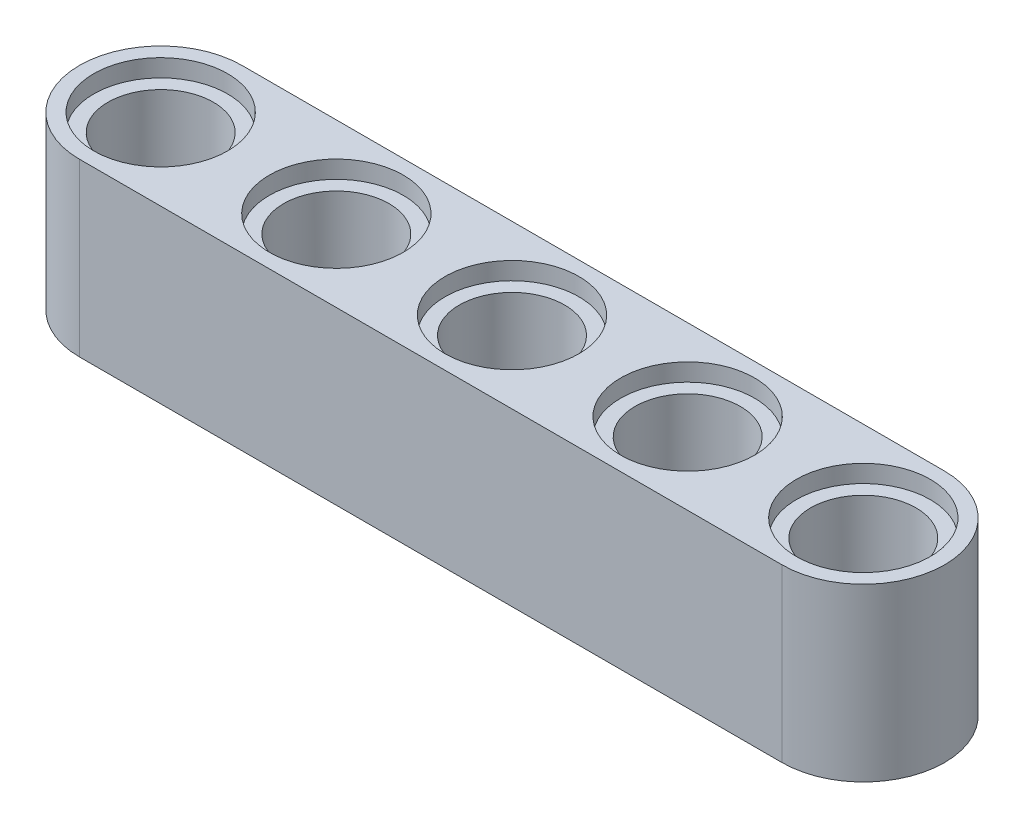
ISO-10303-21;
HEADER;
FILE_DESCRIPTION(('STEP AP214'),'2;1');
FILE_NAME('part.step','',(''),(''),'','','');
FILE_SCHEMA(('AUTOMOTIVE_DESIGN { 1 0 10303 214 1 1 1 1 }'));
ENDSEC;
DATA;
#1=APPLICATION_CONTEXT('core data for automotive mechanical design processes');
#2=APPLICATION_PROTOCOL_DEFINITION('international standard','automotive_design',2000,#1);
#3=PRODUCT_CONTEXT('',#1,'mechanical');
#4=PRODUCT('Part','Part','',(#3));
#5=PRODUCT_RELATED_PRODUCT_CATEGORY('part','',(#4));
#6=PRODUCT_DEFINITION_FORMATION('','',#4);
#7=PRODUCT_DEFINITION_CONTEXT('part definition',#1,'design');
#8=PRODUCT_DEFINITION('design','',#6,#7);
#9=PRODUCT_DEFINITION_SHAPE('','',#8);
#10=(LENGTH_UNIT() NAMED_UNIT(*) SI_UNIT(.MILLI.,.METRE.));
#11=(NAMED_UNIT(*) PLANE_ANGLE_UNIT() SI_UNIT($,.RADIAN.));
#12=(NAMED_UNIT(*) SI_UNIT($,.STERADIAN.) SOLID_ANGLE_UNIT());
#13=UNCERTAINTY_MEASURE_WITH_UNIT(LENGTH_MEASURE(1.E-05),#10,'distance_accuracy_value','');
#14=(GEOMETRIC_REPRESENTATION_CONTEXT(3) GLOBAL_UNCERTAINTY_ASSIGNED_CONTEXT((#13)) GLOBAL_UNIT_ASSIGNED_CONTEXT((#10,
#11,#12)) REPRESENTATION_CONTEXT('',''));
#15=CARTESIAN_POINT('',(0.,0.,0.));
#16=DIRECTION('',(0.,0.,1.));
#17=DIRECTION('',(1.,0.,0.));
#18=AXIS2_PLACEMENT_3D('',#15,#16,#17);
#19=CARTESIAN_POINT('',(8.,0.,0.));
#20=DIRECTION('',(0.,1.,0.));
#21=DIRECTION('',(0.,0.,1.));
#22=AXIS2_PLACEMENT_3D('',#19,#20,#21);
#23=CYLINDRICAL_SURFACE('',#22,2.4);
#24=CARTESIAN_POINT('',(8.,7.,0.));
#25=DIRECTION('',(0.,1.,0.));
#26=DIRECTION('',(0.,0.,1.));
#27=AXIS2_PLACEMENT_3D('',#24,#25,#26);
#28=CIRCLE('',#27,2.4);
#29=CARTESIAN_POINT('',(8.,7.,2.4));
#30=VERTEX_POINT('',#29);
#31=EDGE_CURVE('E125',#30,#30,#28,.F.);
#32=ORIENTED_EDGE('',*,*,#31,.F.);
#33=EDGE_LOOP('',(#32));
#34=FACE_BOUND('',#33,.T.);
#35=CARTESIAN_POINT('',(8.,0.8,0.));
#36=DIRECTION('',(0.,-1.,0.));
#37=DIRECTION('',(0.,0.,-1.));
#38=AXIS2_PLACEMENT_3D('',#35,#36,#37);
#39=CIRCLE('',#38,2.4);
#40=CARTESIAN_POINT('',(8.,0.8,-2.4));
#41=VERTEX_POINT('',#40);
#42=EDGE_CURVE('E40',#41,#41,#39,.F.);
#43=ORIENTED_EDGE('',*,*,#42,.F.);
#44=EDGE_LOOP('',(#43));
#45=FACE_BOUND('',#44,.T.);
#46=ADVANCED_FACE('F36',(#34,#45),#23,.F.);
#47=CARTESIAN_POINT('',(0.,0.,0.));
#48=DIRECTION('',(0.,1.,0.));
#49=DIRECTION('',(0.,0.,1.));
#50=AXIS2_PLACEMENT_3D('',#47,#48,#49);
#51=CYLINDRICAL_SURFACE('',#50,2.4);
#52=CARTESIAN_POINT('',(0.,7.,0.));
#53=DIRECTION('',(0.,1.,0.));
#54=DIRECTION('',(0.,0.,1.));
#55=AXIS2_PLACEMENT_3D('',#52,#53,#54);
#56=CIRCLE('',#55,2.4);
#57=CARTESIAN_POINT('',(0.,7.,2.4));
#58=VERTEX_POINT('',#57);
#59=EDGE_CURVE('E122',#58,#58,#56,.F.);
#60=ORIENTED_EDGE('',*,*,#59,.F.);
#61=EDGE_LOOP('',(#60));
#62=FACE_BOUND('',#61,.T.);
#63=CARTESIAN_POINT('',(0.,0.8,0.));
#64=DIRECTION('',(0.,-1.,0.));
#65=DIRECTION('',(0.,0.,-1.));
#66=AXIS2_PLACEMENT_3D('',#63,#64,#65);
#67=CIRCLE('',#66,2.4);
#68=CARTESIAN_POINT('',(0.,0.8,-2.4));
#69=VERTEX_POINT('',#68);
#70=EDGE_CURVE('E139',#69,#69,#67,.F.);
#71=ORIENTED_EDGE('',*,*,#70,.F.);
#72=EDGE_LOOP('',(#71));
#73=FACE_BOUND('',#72,.T.);
#74=ADVANCED_FACE('F215',(#62,#73),#51,.F.);
#75=CARTESIAN_POINT('',(-16.,0.,0.));
#76=DIRECTION('',(0.,1.,0.));
#77=DIRECTION('',(0.,0.,1.));
#78=AXIS2_PLACEMENT_3D('',#75,#76,#77);
#79=CYLINDRICAL_SURFACE('',#78,2.4);
#80=CARTESIAN_POINT('',(-16.,7.,0.));
#81=DIRECTION('',(0.,1.,0.));
#82=DIRECTION('',(0.,0.,1.));
#83=AXIS2_PLACEMENT_3D('',#80,#81,#82);
#84=CIRCLE('',#83,2.4);
#85=CARTESIAN_POINT('',(-16.,7.,2.4));
#86=VERTEX_POINT('',#85);
#87=EDGE_CURVE('E115',#86,#86,#84,.F.);
#88=ORIENTED_EDGE('',*,*,#87,.F.);
#89=EDGE_LOOP('',(#88));
#90=FACE_BOUND('',#89,.T.);
#91=CARTESIAN_POINT('',(-16.,0.8,0.));
#92=DIRECTION('',(0.,-1.,0.));
#93=DIRECTION('',(0.,0.,-1.));
#94=AXIS2_PLACEMENT_3D('',#91,#92,#93);
#95=CIRCLE('',#94,2.4);
#96=CARTESIAN_POINT('',(-16.,0.8,-2.4));
#97=VERTEX_POINT('',#96);
#98=EDGE_CURVE('E137',#97,#97,#95,.F.);
#99=ORIENTED_EDGE('',*,*,#98,.F.);
#100=EDGE_LOOP('',(#99));
#101=FACE_BOUND('',#100,.T.);
#102=ADVANCED_FACE('F190',(#90,#101),#79,.F.);
#103=CARTESIAN_POINT('',(16.,7.8,0.));
#104=DIRECTION('',(0.,-1.,0.));
#105=DIRECTION('',(0.,0.,-1.));
#106=AXIS2_PLACEMENT_3D('',#103,#104,#105);
#107=PLANE('',#106);
#108=CARTESIAN_POINT('',(-8.,7.8,0.));
#109=DIRECTION('',(0.,1.,0.));
#110=DIRECTION('',(0.,0.,-1.));
#111=AXIS2_PLACEMENT_3D('',#108,#109,#110);
#112=CIRCLE('',#111,3.05);
#113=CARTESIAN_POINT('',(-8.,7.8,-3.05));
#114=VERTEX_POINT('',#113);
#115=EDGE_CURVE('E144',#114,#114,#112,.T.);
#116=ORIENTED_EDGE('',*,*,#115,.F.);
#117=EDGE_LOOP('',(#116));
#118=FACE_BOUND('',#117,.T.);
#119=CARTESIAN_POINT('',(-16.,7.8,0.));
#120=DIRECTION('',(0.,1.,0.));
#121=DIRECTION('',(0.,0.,1.));
#122=AXIS2_PLACEMENT_3D('',#119,#120,#121);
#123=CIRCLE('',#122,3.05);
#124=CARTESIAN_POINT('',(-16.,7.8,3.05));
#125=VERTEX_POINT('',#124);
#126=EDGE_CURVE('E153',#125,#125,#123,.T.);
#127=ORIENTED_EDGE('',*,*,#126,.F.);
#128=EDGE_LOOP('',(#127));
#129=FACE_BOUND('',#128,.T.);
#130=CARTESIAN_POINT('',(16.,7.8,0.));
#131=DIRECTION('',(0.,1.,0.));
#132=DIRECTION('',(0.,0.,-1.));
#133=AXIS2_PLACEMENT_3D('',#130,#131,#132);
#134=CIRCLE('',#133,3.05);
#135=CARTESIAN_POINT('',(16.,7.8,-3.05));
#136=VERTEX_POINT('',#135);
#137=EDGE_CURVE('E177',#136,#136,#134,.T.);
#138=ORIENTED_EDGE('',*,*,#137,.F.);
#139=EDGE_LOOP('',(#138));
#140=FACE_BOUND('',#139,.T.);
#141=CARTESIAN_POINT('',(0.,7.8,0.));
#142=DIRECTION('',(0.,1.,0.));
#143=DIRECTION('',(0.,0.,1.));
#144=AXIS2_PLACEMENT_3D('',#141,#142,#143);
#145=CIRCLE('',#144,3.05);
#146=CARTESIAN_POINT('',(0.,7.8,3.05));
#147=VERTEX_POINT('',#146);
#148=EDGE_CURVE('E164',#147,#147,#145,.T.);
#149=ORIENTED_EDGE('',*,*,#148,.F.);
#150=EDGE_LOOP('',(#149));
#151=FACE_BOUND('',#150,.T.);
#152=CARTESIAN_POINT('',(8.,7.8,0.));
#153=DIRECTION('',(0.,1.,0.));
#154=DIRECTION('',(0.,0.,1.));
#155=AXIS2_PLACEMENT_3D('',#152,#153,#154);
#156=CIRCLE('',#155,3.05);
#157=CARTESIAN_POINT('',(8.,7.8,3.05));
#158=VERTEX_POINT('',#157);
#159=EDGE_CURVE('E158',#158,#158,#156,.T.);
#160=ORIENTED_EDGE('',*,*,#159,.F.);
#161=EDGE_LOOP('',(#160));
#162=FACE_BOUND('',#161,.T.);
#163=DIRECTION('',(1.,0.,0.));
#164=VECTOR('',#163,1.);
#165=CARTESIAN_POINT('',(-16.,7.8,-3.7));
#166=LINE('',#165,#164);
#167=CARTESIAN_POINT('',(-16.,7.8,-3.7));
#168=VERTEX_POINT('',#167);
#169=CARTESIAN_POINT('',(16.,7.8,-3.7));
#170=VERTEX_POINT('',#169);
#171=EDGE_CURVE('E99',#168,#170,#166,.T.);
#172=ORIENTED_EDGE('',*,*,#171,.F.);
#173=CARTESIAN_POINT('',(-16.,7.8,0.));
#174=DIRECTION('',(0.,1.,0.));
#175=DIRECTION('',(0.,0.,1.));
#176=AXIS2_PLACEMENT_3D('',#173,#174,#175);
#177=CIRCLE('',#176,3.7);
#178=CARTESIAN_POINT('',(-16.,7.8,3.7));
#179=VERTEX_POINT('',#178);
#180=EDGE_CURVE('E88',#168,#179,#177,.T.);
#181=ORIENTED_EDGE('',*,*,#180,.T.);
#182=DIRECTION('',(1.,0.,0.));
#183=VECTOR('',#182,1.);
#184=CARTESIAN_POINT('',(-16.,7.8,3.7));
#185=LINE('',#184,#183);
#186=CARTESIAN_POINT('',(16.,7.8,3.7));
#187=VERTEX_POINT('',#186);
#188=EDGE_CURVE('E83',#179,#187,#185,.T.);
#189=ORIENTED_EDGE('',*,*,#188,.T.);
#190=CARTESIAN_POINT('',(16.,7.8,0.));
#191=DIRECTION('',(0.,-1.,0.));
#192=DIRECTION('',(0.,0.,-1.));
#193=AXIS2_PLACEMENT_3D('',#190,#191,#192);
#194=CIRCLE('',#193,3.7);
#195=EDGE_CURVE('E87',#170,#187,#194,.T.);
#196=ORIENTED_EDGE('',*,*,#195,.F.);
#197=EDGE_LOOP('',(#172,#181,#189,#196));
#198=FACE_BOUND('',#197,.T.);
#199=ADVANCED_FACE('F86',(#118,#129,#140,#151,#162,#198),#107,.F.);
#200=CARTESIAN_POINT('',(16.,0.,0.));
#201=DIRECTION('',(0.,-1.,0.));
#202=DIRECTION('',(0.,0.,-1.));
#203=AXIS2_PLACEMENT_3D('',#200,#201,#202);
#204=PLANE('',#203);
#205=CARTESIAN_POINT('',(-8.,0.,0.));
#206=DIRECTION('',(0.,-1.,0.));
#207=DIRECTION('',(0.,0.,1.));
#208=AXIS2_PLACEMENT_3D('',#205,#206,#207);
#209=CIRCLE('',#208,3.05);
#210=CARTESIAN_POINT('',(-8.,0.,3.05));
#211=VERTEX_POINT('',#210);
#212=EDGE_CURVE('E468',#211,#211,#209,.T.);
#213=ORIENTED_EDGE('',*,*,#212,.F.);
#214=EDGE_LOOP('',(#213));
#215=FACE_BOUND('',#214,.T.);
#216=CARTESIAN_POINT('',(-16.,0.,0.));
#217=DIRECTION('',(0.,-1.,0.));
#218=DIRECTION('',(0.,0.,-1.));
#219=AXIS2_PLACEMENT_3D('',#216,#217,#218);
#220=CIRCLE('',#219,3.05);
#221=CARTESIAN_POINT('',(-16.,0.,-3.05));
#222=VERTEX_POINT('',#221);
#223=EDGE_CURVE('E462',#222,#222,#220,.T.);
#224=ORIENTED_EDGE('',*,*,#223,.F.);
#225=EDGE_LOOP('',(#224));
#226=FACE_BOUND('',#225,.T.);
#227=CARTESIAN_POINT('',(16.,0.,0.));
#228=DIRECTION('',(0.,-1.,0.));
#229=DIRECTION('',(0.,0.,1.));
#230=AXIS2_PLACEMENT_3D('',#227,#228,#229);
#231=CIRCLE('',#230,3.05);
#232=CARTESIAN_POINT('',(16.,0.,3.05));
#233=VERTEX_POINT('',#232);
#234=EDGE_CURVE('E457',#233,#233,#231,.T.);
#235=ORIENTED_EDGE('',*,*,#234,.F.);
#236=EDGE_LOOP('',(#235));
#237=FACE_BOUND('',#236,.T.);
#238=CARTESIAN_POINT('',(0.,0.,0.));
#239=DIRECTION('',(0.,-1.,0.));
#240=DIRECTION('',(0.,0.,-1.));
#241=AXIS2_PLACEMENT_3D('',#238,#239,#240);
#242=CIRCLE('',#241,3.05);
#243=CARTESIAN_POINT('',(0.,0.,-3.05));
#244=VERTEX_POINT('',#243);
#245=EDGE_CURVE('E448',#244,#244,#242,.T.);
#246=ORIENTED_EDGE('',*,*,#245,.F.);
#247=EDGE_LOOP('',(#246));
#248=FACE_BOUND('',#247,.T.);
#249=CARTESIAN_POINT('',(8.,0.,0.));
#250=DIRECTION('',(0.,-1.,0.));
#251=DIRECTION('',(0.,0.,-1.));
#252=AXIS2_PLACEMENT_3D('',#249,#250,#251);
#253=CIRCLE('',#252,3.05);
#254=CARTESIAN_POINT('',(8.,0.,-3.05));
#255=VERTEX_POINT('',#254);
#256=EDGE_CURVE('E172',#255,#255,#253,.T.);
#257=ORIENTED_EDGE('',*,*,#256,.F.);
#258=EDGE_LOOP('',(#257));
#259=FACE_BOUND('',#258,.T.);
#260=DIRECTION('',(1.,0.,0.));
#261=VECTOR('',#260,1.);
#262=CARTESIAN_POINT('',(-16.,0.,-3.7));
#263=LINE('',#262,#261);
#264=CARTESIAN_POINT('',(-16.,0.,-3.7));
#265=VERTEX_POINT('',#264);
#266=CARTESIAN_POINT('',(16.,0.,-3.7));
#267=VERTEX_POINT('',#266);
#268=EDGE_CURVE('E105',#265,#267,#263,.T.);
#269=ORIENTED_EDGE('',*,*,#268,.T.);
#270=CARTESIAN_POINT('',(16.,0.,0.));
#271=DIRECTION('',(0.,-1.,0.));
#272=DIRECTION('',(0.,0.,-1.));
#273=AXIS2_PLACEMENT_3D('',#270,#271,#272);
#274=CIRCLE('',#273,3.7);
#275=CARTESIAN_POINT('',(16.,0.,3.7));
#276=VERTEX_POINT('',#275);
#277=EDGE_CURVE('E108',#267,#276,#274,.T.);
#278=ORIENTED_EDGE('',*,*,#277,.T.);
#279=DIRECTION('',(1.,0.,0.));
#280=VECTOR('',#279,1.);
#281=CARTESIAN_POINT('',(-16.,0.,3.7));
#282=LINE('',#281,#280);
#283=CARTESIAN_POINT('',(-16.,0.,3.7));
#284=VERTEX_POINT('',#283);
#285=EDGE_CURVE('E95',#284,#276,#282,.T.);
#286=ORIENTED_EDGE('',*,*,#285,.F.);
#287=CARTESIAN_POINT('',(-16.,0.,0.));
#288=DIRECTION('',(0.,1.,0.));
#289=DIRECTION('',(0.,0.,1.));
#290=AXIS2_PLACEMENT_3D('',#287,#288,#289);
#291=CIRCLE('',#290,3.7);
#292=EDGE_CURVE('E70',#265,#284,#291,.T.);
#293=ORIENTED_EDGE('',*,*,#292,.F.);
#294=EDGE_LOOP('',(#269,#278,#286,#293));
#295=FACE_BOUND('',#294,.T.);
#296=ADVANCED_FACE('F189',(#215,#226,#237,#248,#259,#295),#204,.T.);
#297=CARTESIAN_POINT('',(-16.,7.8,-3.7));
#298=DIRECTION('',(0.,0.,-1.));
#299=DIRECTION('',(-1.,0.,0.));
#300=AXIS2_PLACEMENT_3D('',#297,#298,#299);
#301=PLANE('',#300);
#302=ORIENTED_EDGE('',*,*,#268,.F.);
#303=DIRECTION('',(0.,-1.,0.));
#304=VECTOR('',#303,1.);
#305=CARTESIAN_POINT('',(-16.,7.8,-3.7));
#306=LINE('',#305,#304);
#307=EDGE_CURVE('E11',#168,#265,#306,.T.);
#308=ORIENTED_EDGE('',*,*,#307,.F.);
#309=ORIENTED_EDGE('',*,*,#171,.T.);
#310=DIRECTION('',(0.,-1.,0.));
#311=VECTOR('',#310,1.);
#312=CARTESIAN_POINT('',(16.,7.8,-3.7));
#313=LINE('',#312,#311);
#314=EDGE_CURVE('E78',#170,#267,#313,.T.);
#315=ORIENTED_EDGE('',*,*,#314,.T.);
#316=EDGE_LOOP('',(#302,#308,#309,#315));
#317=FACE_BOUND('',#316,.T.);
#318=ADVANCED_FACE('F38',(#317),#301,.T.);
#319=CARTESIAN_POINT('',(-16.,7.8,0.));
#320=DIRECTION('',(0.,-1.,0.));
#321=DIRECTION('',(0.,0.,-1.));
#322=AXIS2_PLACEMENT_3D('',#319,#320,#321);
#323=CYLINDRICAL_SURFACE('',#322,3.7);
#324=ORIENTED_EDGE('',*,*,#292,.T.);
#325=DIRECTION('',(0.,-1.,0.));
#326=VECTOR('',#325,1.);
#327=CARTESIAN_POINT('',(-16.,7.8,3.7));
#328=LINE('',#327,#326);
#329=EDGE_CURVE('E46',#179,#284,#328,.T.);
#330=ORIENTED_EDGE('',*,*,#329,.F.);
#331=ORIENTED_EDGE('',*,*,#180,.F.);
#332=ORIENTED_EDGE('',*,*,#307,.T.);
#333=EDGE_LOOP('',(#324,#330,#331,#332));
#334=FACE_BOUND('',#333,.T.);
#335=ADVANCED_FACE('F235',(#334),#323,.T.);
#336=CARTESIAN_POINT('',(-16.,7.8,3.7));
#337=DIRECTION('',(0.,0.,-1.));
#338=DIRECTION('',(-1.,0.,0.));
#339=AXIS2_PLACEMENT_3D('',#336,#337,#338);
#340=PLANE('',#339);
#341=ORIENTED_EDGE('',*,*,#285,.T.);
#342=DIRECTION('',(0.,-1.,0.));
#343=VECTOR('',#342,1.);
#344=CARTESIAN_POINT('',(16.,7.8,3.7));
#345=LINE('',#344,#343);
#346=EDGE_CURVE('E92',#187,#276,#345,.T.);
#347=ORIENTED_EDGE('',*,*,#346,.F.);
#348=ORIENTED_EDGE('',*,*,#188,.F.);
#349=ORIENTED_EDGE('',*,*,#329,.T.);
#350=EDGE_LOOP('',(#341,#347,#348,#349));
#351=FACE_BOUND('',#350,.T.);
#352=ADVANCED_FACE('F93',(#351),#340,.F.);
#353=CARTESIAN_POINT('',(16.,7.8,0.));
#354=DIRECTION('',(0.,-1.,0.));
#355=DIRECTION('',(0.,0.,-1.));
#356=AXIS2_PLACEMENT_3D('',#353,#354,#355);
#357=CYLINDRICAL_SURFACE('',#356,3.7);
#358=ORIENTED_EDGE('',*,*,#277,.F.);
#359=ORIENTED_EDGE('',*,*,#314,.F.);
#360=ORIENTED_EDGE('',*,*,#195,.T.);
#361=ORIENTED_EDGE('',*,*,#346,.T.);
#362=EDGE_LOOP('',(#358,#359,#360,#361));
#363=FACE_BOUND('',#362,.T.);
#364=ADVANCED_FACE('F98',(#363),#357,.T.);
#365=CARTESIAN_POINT('',(16.,0.,0.));
#366=DIRECTION('',(0.,1.,0.));
#367=DIRECTION('',(0.,0.,1.));
#368=AXIS2_PLACEMENT_3D('',#365,#366,#367);
#369=CYLINDRICAL_SURFACE('',#368,2.4);
#370=CARTESIAN_POINT('',(16.,0.8,0.));
#371=DIRECTION('',(0.,1.,0.));
#372=DIRECTION('',(0.,0.,1.));
#373=AXIS2_PLACEMENT_3D('',#370,#371,#372);
#374=CIRCLE('',#373,2.4);
#375=CARTESIAN_POINT('',(16.,0.8,2.4));
#376=VERTEX_POINT('',#375);
#377=EDGE_CURVE('E133',#376,#376,#374,.T.);
#378=ORIENTED_EDGE('',*,*,#377,.F.);
#379=EDGE_LOOP('',(#378));
#380=FACE_BOUND('',#379,.T.);
#381=CARTESIAN_POINT('',(16.,7.,0.));
#382=DIRECTION('',(0.,-1.,0.));
#383=DIRECTION('',(0.,0.,-1.));
#384=AXIS2_PLACEMENT_3D('',#381,#382,#383);
#385=CIRCLE('',#384,2.4);
#386=CARTESIAN_POINT('',(16.,7.,-2.4));
#387=VERTEX_POINT('',#386);
#388=EDGE_CURVE('E109',#387,#387,#385,.T.);
#389=ORIENTED_EDGE('',*,*,#388,.F.);
#390=EDGE_LOOP('',(#389));
#391=FACE_BOUND('',#390,.T.);
#392=ADVANCED_FACE('F227',(#380,#391),#369,.F.);
#393=CARTESIAN_POINT('',(-8.,0.,0.));
#394=DIRECTION('',(0.,1.,0.));
#395=DIRECTION('',(0.,0.,1.));
#396=AXIS2_PLACEMENT_3D('',#393,#394,#395);
#397=CYLINDRICAL_SURFACE('',#396,2.4);
#398=CARTESIAN_POINT('',(-8.,0.8,0.));
#399=DIRECTION('',(0.,1.,0.));
#400=DIRECTION('',(0.,0.,1.));
#401=AXIS2_PLACEMENT_3D('',#398,#399,#400);
#402=CIRCLE('',#401,2.4);
#403=CARTESIAN_POINT('',(-8.,0.8,2.4));
#404=VERTEX_POINT('',#403);
#405=EDGE_CURVE('E130',#404,#404,#402,.T.);
#406=ORIENTED_EDGE('',*,*,#405,.F.);
#407=EDGE_LOOP('',(#406));
#408=FACE_BOUND('',#407,.T.);
#409=CARTESIAN_POINT('',(-8.,7.,0.));
#410=DIRECTION('',(0.,-1.,0.));
#411=DIRECTION('',(0.,0.,-1.));
#412=AXIS2_PLACEMENT_3D('',#409,#410,#411);
#413=CIRCLE('',#412,2.4);
#414=CARTESIAN_POINT('',(-8.,7.,-2.4));
#415=VERTEX_POINT('',#414);
#416=EDGE_CURVE('E118',#415,#415,#413,.T.);
#417=ORIENTED_EDGE('',*,*,#416,.F.);
#418=EDGE_LOOP('',(#417));
#419=FACE_BOUND('',#418,.T.);
#420=ADVANCED_FACE('F229',(#408,#419),#397,.F.);
#421=CARTESIAN_POINT('',(-16.,7.,0.));
#422=DIRECTION('',(0.,1.,0.));
#423=DIRECTION('',(0.,0.,1.));
#424=AXIS2_PLACEMENT_3D('',#421,#422,#423);
#425=PLANE('',#424);
#426=CARTESIAN_POINT('',(-16.,7.,0.));
#427=DIRECTION('',(0.,1.,0.));
#428=DIRECTION('',(0.,0.,1.));
#429=AXIS2_PLACEMENT_3D('',#426,#427,#428);
#430=CIRCLE('',#429,3.05);
#431=CARTESIAN_POINT('',(-16.,7.,3.05));
#432=VERTEX_POINT('',#431);
#433=EDGE_CURVE('E180',#432,#432,#430,.T.);
#434=ORIENTED_EDGE('',*,*,#433,.T.);
#435=EDGE_LOOP('',(#434));
#436=FACE_BOUND('',#435,.T.);
#437=ORIENTED_EDGE('',*,*,#87,.T.);
#438=EDGE_LOOP('',(#437));
#439=FACE_BOUND('',#438,.T.);
#440=ADVANCED_FACE('F256',(#436,#439),#425,.T.);
#441=CARTESIAN_POINT('',(-16.,7.,0.));
#442=DIRECTION('',(0.,1.,0.));
#443=DIRECTION('',(0.,0.,1.));
#444=AXIS2_PLACEMENT_3D('',#441,#442,#443);
#445=CYLINDRICAL_SURFACE('',#444,3.05);
#446=ORIENTED_EDGE('',*,*,#433,.F.);
#447=EDGE_LOOP('',(#446));
#448=FACE_BOUND('',#447,.T.);
#449=ORIENTED_EDGE('',*,*,#126,.T.);
#450=EDGE_LOOP('',(#449));
#451=FACE_BOUND('',#450,.T.);
#452=ADVANCED_FACE('F185',(#448,#451),#445,.F.);
#453=CARTESIAN_POINT('',(-8.,7.,0.));
#454=DIRECTION('',(0.,1.,0.));
#455=DIRECTION('',(0.,0.,1.));
#456=AXIS2_PLACEMENT_3D('',#453,#454,#455);
#457=CYLINDRICAL_SURFACE('',#456,3.05);
#458=CARTESIAN_POINT('',(-8.,7.,0.));
#459=DIRECTION('',(0.,1.,0.));
#460=DIRECTION('',(0.,0.,-1.));
#461=AXIS2_PLACEMENT_3D('',#458,#459,#460);
#462=CIRCLE('',#461,3.05);
#463=CARTESIAN_POINT('',(-8.,7.,-3.05));
#464=VERTEX_POINT('',#463);
#465=EDGE_CURVE('E148',#464,#464,#462,.T.);
#466=ORIENTED_EDGE('',*,*,#465,.F.);
#467=EDGE_LOOP('',(#466));
#468=FACE_BOUND('',#467,.T.);
#469=ORIENTED_EDGE('',*,*,#115,.T.);
#470=EDGE_LOOP('',(#469));
#471=FACE_BOUND('',#470,.T.);
#472=ADVANCED_FACE('F271',(#468,#471),#457,.F.);
#473=CARTESIAN_POINT('',(-8.,7.,0.));
#474=DIRECTION('',(0.,-1.,0.));
#475=DIRECTION('',(0.,0.,-1.));
#476=AXIS2_PLACEMENT_3D('',#473,#474,#475);
#477=PLANE('',#476);
#478=ORIENTED_EDGE('',*,*,#416,.T.);
#479=EDGE_LOOP('',(#478));
#480=FACE_BOUND('',#479,.T.);
#481=ORIENTED_EDGE('',*,*,#465,.T.);
#482=EDGE_LOOP('',(#481));
#483=FACE_BOUND('',#482,.T.);
#484=ADVANCED_FACE('F211',(#480,#483),#477,.F.);
#485=CARTESIAN_POINT('',(0.,7.,0.));
#486=DIRECTION('',(0.,1.,0.));
#487=DIRECTION('',(0.,0.,1.));
#488=AXIS2_PLACEMENT_3D('',#485,#486,#487);
#489=PLANE('',#488);
#490=CARTESIAN_POINT('',(0.,7.,0.));
#491=DIRECTION('',(0.,1.,0.));
#492=DIRECTION('',(0.,0.,1.));
#493=AXIS2_PLACEMENT_3D('',#490,#491,#492);
#494=CIRCLE('',#493,3.05);
#495=CARTESIAN_POINT('',(0.,7.,3.05));
#496=VERTEX_POINT('',#495);
#497=EDGE_CURVE('E160',#496,#496,#494,.T.);
#498=ORIENTED_EDGE('',*,*,#497,.T.);
#499=EDGE_LOOP('',(#498));
#500=FACE_BOUND('',#499,.T.);
#501=ORIENTED_EDGE('',*,*,#59,.T.);
#502=EDGE_LOOP('',(#501));
#503=FACE_BOUND('',#502,.T.);
#504=ADVANCED_FACE('F201',(#500,#503),#489,.T.);
#505=CARTESIAN_POINT('',(0.,7.,0.));
#506=DIRECTION('',(0.,1.,0.));
#507=DIRECTION('',(0.,0.,1.));
#508=AXIS2_PLACEMENT_3D('',#505,#506,#507);
#509=CYLINDRICAL_SURFACE('',#508,3.05);
#510=ORIENTED_EDGE('',*,*,#497,.F.);
#511=EDGE_LOOP('',(#510));
#512=FACE_BOUND('',#511,.T.);
#513=ORIENTED_EDGE('',*,*,#148,.T.);
#514=EDGE_LOOP('',(#513));
#515=FACE_BOUND('',#514,.T.);
#516=ADVANCED_FACE('F198',(#512,#515),#509,.F.);
#517=CARTESIAN_POINT('',(8.,7.,0.));
#518=DIRECTION('',(0.,1.,0.));
#519=DIRECTION('',(0.,0.,1.));
#520=AXIS2_PLACEMENT_3D('',#517,#518,#519);
#521=PLANE('',#520);
#522=CARTESIAN_POINT('',(8.,7.,0.));
#523=DIRECTION('',(0.,1.,0.));
#524=DIRECTION('',(0.,0.,1.));
#525=AXIS2_PLACEMENT_3D('',#522,#523,#524);
#526=CIRCLE('',#525,3.05);
#527=CARTESIAN_POINT('',(8.,7.,3.05));
#528=VERTEX_POINT('',#527);
#529=EDGE_CURVE('E119',#528,#528,#526,.T.);
#530=ORIENTED_EDGE('',*,*,#529,.T.);
#531=EDGE_LOOP('',(#530));
#532=FACE_BOUND('',#531,.T.);
#533=ORIENTED_EDGE('',*,*,#31,.T.);
#534=EDGE_LOOP('',(#533));
#535=FACE_BOUND('',#534,.T.);
#536=ADVANCED_FACE('F200',(#532,#535),#521,.T.);
#537=CARTESIAN_POINT('',(8.,7.,0.));
#538=DIRECTION('',(0.,1.,0.));
#539=DIRECTION('',(0.,0.,1.));
#540=AXIS2_PLACEMENT_3D('',#537,#538,#539);
#541=CYLINDRICAL_SURFACE('',#540,3.05);
#542=ORIENTED_EDGE('',*,*,#529,.F.);
#543=EDGE_LOOP('',(#542));
#544=FACE_BOUND('',#543,.T.);
#545=ORIENTED_EDGE('',*,*,#159,.T.);
#546=EDGE_LOOP('',(#545));
#547=FACE_BOUND('',#546,.T.);
#548=ADVANCED_FACE('F208',(#544,#547),#541,.F.);
#549=CARTESIAN_POINT('',(16.,7.,0.));
#550=DIRECTION('',(0.,1.,0.));
#551=DIRECTION('',(0.,0.,1.));
#552=AXIS2_PLACEMENT_3D('',#549,#550,#551);
#553=CYLINDRICAL_SURFACE('',#552,3.05);
#554=CARTESIAN_POINT('',(16.,7.,0.));
#555=DIRECTION('',(0.,1.,0.));
#556=DIRECTION('',(0.,0.,-1.));
#557=AXIS2_PLACEMENT_3D('',#554,#555,#556);
#558=CIRCLE('',#557,3.05);
#559=CARTESIAN_POINT('',(16.,7.,-3.05));
#560=VERTEX_POINT('',#559);
#561=EDGE_CURVE('E169',#560,#560,#558,.T.);
#562=ORIENTED_EDGE('',*,*,#561,.F.);
#563=EDGE_LOOP('',(#562));
#564=FACE_BOUND('',#563,.T.);
#565=ORIENTED_EDGE('',*,*,#137,.T.);
#566=EDGE_LOOP('',(#565));
#567=FACE_BOUND('',#566,.T.);
#568=ADVANCED_FACE('F310',(#564,#567),#553,.F.);
#569=CARTESIAN_POINT('',(16.,7.,0.));
#570=DIRECTION('',(0.,-1.,0.));
#571=DIRECTION('',(0.,0.,-1.));
#572=AXIS2_PLACEMENT_3D('',#569,#570,#571);
#573=PLANE('',#572);
#574=ORIENTED_EDGE('',*,*,#388,.T.);
#575=EDGE_LOOP('',(#574));
#576=FACE_BOUND('',#575,.T.);
#577=ORIENTED_EDGE('',*,*,#561,.T.);
#578=EDGE_LOOP('',(#577));
#579=FACE_BOUND('',#578,.T.);
#580=ADVANCED_FACE('F320',(#576,#579),#573,.F.);
#581=CARTESIAN_POINT('',(-8.,0.8,0.));
#582=DIRECTION('',(0.,-1.,0.));
#583=DIRECTION('',(0.,0.,-1.));
#584=AXIS2_PLACEMENT_3D('',#581,#582,#583);
#585=CYLINDRICAL_SURFACE('',#584,3.05);
#586=CARTESIAN_POINT('',(-8.,0.8,0.));
#587=DIRECTION('',(0.,-1.,0.));
#588=DIRECTION('',(0.,0.,1.));
#589=AXIS2_PLACEMENT_3D('',#586,#587,#588);
#590=CIRCLE('',#589,3.05);
#591=CARTESIAN_POINT('',(-8.,0.8,3.05));
#592=VERTEX_POINT('',#591);
#593=EDGE_CURVE('E465',#592,#592,#590,.T.);
#594=ORIENTED_EDGE('',*,*,#593,.F.);
#595=EDGE_LOOP('',(#594));
#596=FACE_BOUND('',#595,.T.);
#597=ORIENTED_EDGE('',*,*,#212,.T.);
#598=EDGE_LOOP('',(#597));
#599=FACE_BOUND('',#598,.T.);
#600=ADVANCED_FACE('F329',(#596,#599),#585,.F.);
#601=CARTESIAN_POINT('',(-8.,0.8,0.));
#602=DIRECTION('',(0.,1.,0.));
#603=DIRECTION('',(0.,0.,1.));
#604=AXIS2_PLACEMENT_3D('',#601,#602,#603);
#605=PLANE('',#604);
#606=ORIENTED_EDGE('',*,*,#405,.T.);
#607=EDGE_LOOP('',(#606));
#608=FACE_BOUND('',#607,.T.);
#609=ORIENTED_EDGE('',*,*,#593,.T.);
#610=EDGE_LOOP('',(#609));
#611=FACE_BOUND('',#610,.T.);
#612=ADVANCED_FACE('F421',(#608,#611),#605,.F.);
#613=CARTESIAN_POINT('',(16.,0.8,0.));
#614=DIRECTION('',(0.,-1.,0.));
#615=DIRECTION('',(0.,0.,-1.));
#616=AXIS2_PLACEMENT_3D('',#613,#614,#615);
#617=CYLINDRICAL_SURFACE('',#616,3.05);
#618=CARTESIAN_POINT('',(16.,0.8,0.));
#619=DIRECTION('',(0.,-1.,0.));
#620=DIRECTION('',(0.,0.,1.));
#621=AXIS2_PLACEMENT_3D('',#618,#619,#620);
#622=CIRCLE('',#621,3.05);
#623=CARTESIAN_POINT('',(16.,0.8,3.05));
#624=VERTEX_POINT('',#623);
#625=EDGE_CURVE('E452',#624,#624,#622,.T.);
#626=ORIENTED_EDGE('',*,*,#625,.F.);
#627=EDGE_LOOP('',(#626));
#628=FACE_BOUND('',#627,.T.);
#629=ORIENTED_EDGE('',*,*,#234,.T.);
#630=EDGE_LOOP('',(#629));
#631=FACE_BOUND('',#630,.T.);
#632=ADVANCED_FACE('F418',(#628,#631),#617,.F.);
#633=CARTESIAN_POINT('',(16.,0.8,0.));
#634=DIRECTION('',(0.,1.,0.));
#635=DIRECTION('',(0.,0.,1.));
#636=AXIS2_PLACEMENT_3D('',#633,#634,#635);
#637=PLANE('',#636);
#638=ORIENTED_EDGE('',*,*,#377,.T.);
#639=EDGE_LOOP('',(#638));
#640=FACE_BOUND('',#639,.T.);
#641=ORIENTED_EDGE('',*,*,#625,.T.);
#642=EDGE_LOOP('',(#641));
#643=FACE_BOUND('',#642,.T.);
#644=ADVANCED_FACE('F431',(#640,#643),#637,.F.);
#645=CARTESIAN_POINT('',(8.,0.8,0.));
#646=DIRECTION('',(0.,-1.,0.));
#647=DIRECTION('',(0.,0.,-1.));
#648=AXIS2_PLACEMENT_3D('',#645,#646,#647);
#649=PLANE('',#648);
#650=CARTESIAN_POINT('',(8.,0.8,0.));
#651=DIRECTION('',(0.,-1.,0.));
#652=DIRECTION('',(0.,0.,-1.));
#653=AXIS2_PLACEMENT_3D('',#650,#651,#652);
#654=CIRCLE('',#653,3.05);
#655=CARTESIAN_POINT('',(8.,0.8,-3.05));
#656=VERTEX_POINT('',#655);
#657=EDGE_CURVE('E134',#656,#656,#654,.T.);
#658=ORIENTED_EDGE('',*,*,#657,.T.);
#659=EDGE_LOOP('',(#658));
#660=FACE_BOUND('',#659,.T.);
#661=ORIENTED_EDGE('',*,*,#42,.T.);
#662=EDGE_LOOP('',(#661));
#663=FACE_BOUND('',#662,.T.);
#664=ADVANCED_FACE('F427',(#660,#663),#649,.T.);
#665=CARTESIAN_POINT('',(8.,0.8,0.));
#666=DIRECTION('',(0.,-1.,0.));
#667=DIRECTION('',(0.,0.,-1.));
#668=AXIS2_PLACEMENT_3D('',#665,#666,#667);
#669=CYLINDRICAL_SURFACE('',#668,3.05);
#670=ORIENTED_EDGE('',*,*,#657,.F.);
#671=EDGE_LOOP('',(#670));
#672=FACE_BOUND('',#671,.T.);
#673=ORIENTED_EDGE('',*,*,#256,.T.);
#674=EDGE_LOOP('',(#673));
#675=FACE_BOUND('',#674,.T.);
#676=ADVANCED_FACE('F430',(#672,#675),#669,.F.);
#677=CARTESIAN_POINT('',(0.,0.8,0.));
#678=DIRECTION('',(0.,-1.,0.));
#679=DIRECTION('',(0.,0.,-1.));
#680=AXIS2_PLACEMENT_3D('',#677,#678,#679);
#681=PLANE('',#680);
#682=CARTESIAN_POINT('',(0.,0.8,0.));
#683=DIRECTION('',(0.,-1.,0.));
#684=DIRECTION('',(0.,0.,-1.));
#685=AXIS2_PLACEMENT_3D('',#682,#683,#684);
#686=CIRCLE('',#685,3.05);
#687=CARTESIAN_POINT('',(0.,0.8,-3.05));
#688=VERTEX_POINT('',#687);
#689=EDGE_CURVE('E446',#688,#688,#686,.T.);
#690=ORIENTED_EDGE('',*,*,#689,.T.);
#691=EDGE_LOOP('',(#690));
#692=FACE_BOUND('',#691,.T.);
#693=ORIENTED_EDGE('',*,*,#70,.T.);
#694=EDGE_LOOP('',(#693));
#695=FACE_BOUND('',#694,.T.);
#696=ADVANCED_FACE('F413',(#692,#695),#681,.T.);
#697=CARTESIAN_POINT('',(0.,0.8,0.));
#698=DIRECTION('',(0.,-1.,0.));
#699=DIRECTION('',(0.,0.,-1.));
#700=AXIS2_PLACEMENT_3D('',#697,#698,#699);
#701=CYLINDRICAL_SURFACE('',#700,3.05);
#702=ORIENTED_EDGE('',*,*,#689,.F.);
#703=EDGE_LOOP('',(#702));
#704=FACE_BOUND('',#703,.T.);
#705=ORIENTED_EDGE('',*,*,#245,.T.);
#706=EDGE_LOOP('',(#705));
#707=FACE_BOUND('',#706,.T.);
#708=ADVANCED_FACE('F404',(#704,#707),#701,.F.);
#709=CARTESIAN_POINT('',(-16.,0.8,0.));
#710=DIRECTION('',(0.,-1.,0.));
#711=DIRECTION('',(0.,0.,-1.));
#712=AXIS2_PLACEMENT_3D('',#709,#710,#711);
#713=PLANE('',#712);
#714=CARTESIAN_POINT('',(-16.,0.8,0.));
#715=DIRECTION('',(0.,-1.,0.));
#716=DIRECTION('',(0.,0.,-1.));
#717=AXIS2_PLACEMENT_3D('',#714,#715,#716);
#718=CIRCLE('',#717,3.05);
#719=CARTESIAN_POINT('',(-16.,0.8,-3.05));
#720=VERTEX_POINT('',#719);
#721=EDGE_CURVE('E460',#720,#720,#718,.T.);
#722=ORIENTED_EDGE('',*,*,#721,.T.);
#723=EDGE_LOOP('',(#722));
#724=FACE_BOUND('',#723,.T.);
#725=ORIENTED_EDGE('',*,*,#98,.T.);
#726=EDGE_LOOP('',(#725));
#727=FACE_BOUND('',#726,.T.);
#728=ADVANCED_FACE('F401',(#724,#727),#713,.T.);
#729=CARTESIAN_POINT('',(-16.,0.8,0.));
#730=DIRECTION('',(0.,-1.,0.));
#731=DIRECTION('',(0.,0.,-1.));
#732=AXIS2_PLACEMENT_3D('',#729,#730,#731);
#733=CYLINDRICAL_SURFACE('',#732,3.05);
#734=ORIENTED_EDGE('',*,*,#721,.F.);
#735=EDGE_LOOP('',(#734));
#736=FACE_BOUND('',#735,.T.);
#737=ORIENTED_EDGE('',*,*,#223,.T.);
#738=EDGE_LOOP('',(#737));
#739=FACE_BOUND('',#738,.T.);
#740=ADVANCED_FACE('F403',(#736,#739),#733,.F.);
#741=CLOSED_SHELL('',(#46,#74,#102,#199,#296,#318,#335,#352,#364,#392,#420,#440,#452,#472,#484,
#504,#516,#536,#548,#568,#580,#600,#612,#632,#644,#664,#676,#696,#708,#728,#740));
#742=MANIFOLD_SOLID_BREP('B2',#741);
#743=ADVANCED_BREP_SHAPE_REPRESENTATION('',(#18,#742),#14);
#744=SHAPE_DEFINITION_REPRESENTATION(#9,#743);
ENDSEC;
END-ISO-10303-21;
